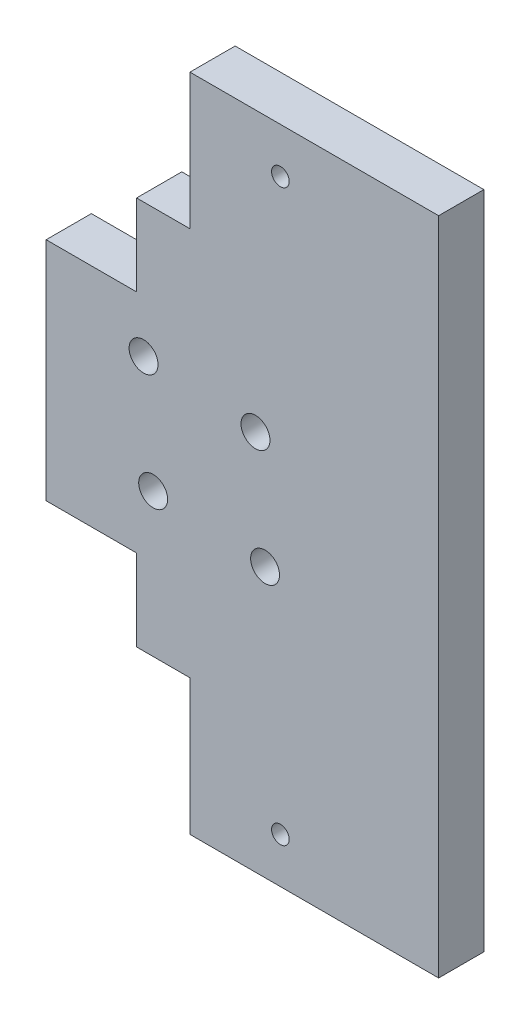
ISO-10303-21;
HEADER;
FILE_DESCRIPTION(('STEP AP214'),'2;1');
FILE_NAME('part.step','',(''),(''),'','','');
FILE_SCHEMA(('AUTOMOTIVE_DESIGN { 1 0 10303 214 1 1 1 1 }'));
ENDSEC;
DATA;
#1=APPLICATION_CONTEXT('core data for automotive mechanical design processes');
#2=APPLICATION_PROTOCOL_DEFINITION('international standard','automotive_design',2000,#1);
#3=PRODUCT_CONTEXT('',#1,'mechanical');
#4=PRODUCT('Part','Part','',(#3));
#5=PRODUCT_RELATED_PRODUCT_CATEGORY('part','',(#4));
#6=PRODUCT_DEFINITION_FORMATION('','',#4);
#7=PRODUCT_DEFINITION_CONTEXT('part definition',#1,'design');
#8=PRODUCT_DEFINITION('design','',#6,#7);
#9=PRODUCT_DEFINITION_SHAPE('','',#8);
#10=(LENGTH_UNIT() NAMED_UNIT(*) SI_UNIT(.MILLI.,.METRE.));
#11=(NAMED_UNIT(*) PLANE_ANGLE_UNIT() SI_UNIT($,.RADIAN.));
#12=(NAMED_UNIT(*) SI_UNIT($,.STERADIAN.) SOLID_ANGLE_UNIT());
#13=UNCERTAINTY_MEASURE_WITH_UNIT(LENGTH_MEASURE(1.E-05),#10,'distance_accuracy_value','');
#14=(GEOMETRIC_REPRESENTATION_CONTEXT(3) GLOBAL_UNCERTAINTY_ASSIGNED_CONTEXT((#13)) GLOBAL_UNIT_ASSIGNED_CONTEXT((#10,
#11,#12)) REPRESENTATION_CONTEXT('',''));
#15=CARTESIAN_POINT('',(0.,0.,0.));
#16=DIRECTION('',(0.,0.,1.));
#17=DIRECTION('',(1.,0.,0.));
#18=AXIS2_PLACEMENT_3D('',#15,#16,#17);
#19=CARTESIAN_POINT('',(-19.2,36.5,5.));
#20=DIRECTION('',(1.,0.,0.));
#21=DIRECTION('',(0.,1.,0.));
#22=AXIS2_PLACEMENT_3D('',#19,#20,#21);
#23=PLANE('',#22);
#24=DIRECTION('',(0.,0.,-1.));
#25=VECTOR('',#24,1.);
#26=CARTESIAN_POINT('',(-19.2,21.5,0.));
#27=LINE('',#26,#25);
#28=CARTESIAN_POINT('',(-19.2,21.5,5.));
#29=VERTEX_POINT('',#28);
#30=CARTESIAN_POINT('',(-19.2,21.5,0.));
#31=VERTEX_POINT('',#30);
#32=EDGE_CURVE('E275',#29,#31,#27,.T.);
#33=ORIENTED_EDGE('',*,*,#32,.T.);
#34=DIRECTION('',(0.,-1.,0.));
#35=VECTOR('',#34,1.);
#36=CARTESIAN_POINT('',(-19.2,36.5,0.));
#37=LINE('',#36,#35);
#38=CARTESIAN_POINT('',(-19.2,12.5,0.));
#39=VERTEX_POINT('',#38);
#40=EDGE_CURVE('E152',#31,#39,#37,.T.);
#41=ORIENTED_EDGE('',*,*,#40,.T.);
#42=DIRECTION('',(0.,0.,-1.));
#43=VECTOR('',#42,1.);
#44=CARTESIAN_POINT('',(-19.2,12.5,0.));
#45=LINE('',#44,#43);
#46=CARTESIAN_POINT('',(-19.2,12.5,5.));
#47=VERTEX_POINT('',#46);
#48=EDGE_CURVE('E177',#47,#39,#45,.T.);
#49=ORIENTED_EDGE('',*,*,#48,.F.);
#50=DIRECTION('',(0.,-1.,0.));
#51=VECTOR('',#50,1.);
#52=CARTESIAN_POINT('',(-19.2,36.5,5.));
#53=LINE('',#52,#51);
#54=EDGE_CURVE('E211',#29,#47,#53,.T.);
#55=ORIENTED_EDGE('',*,*,#54,.F.);
#56=EDGE_LOOP('',(#33,#41,#49,#55));
#57=FACE_BOUND('',#56,.T.);
#58=ADVANCED_FACE('F41',(#57),#23,.F.);
#59=CARTESIAN_POINT('',(-19.2,36.5,5.));
#60=DIRECTION('',(0.,-1.,0.));
#61=DIRECTION('',(0.,0.,-1.));
#62=AXIS2_PLACEMENT_3D('',#59,#60,#61);
#63=PLANE('',#62);
#64=DIRECTION('',(-1.,0.,0.));
#65=VECTOR('',#64,1.);
#66=CARTESIAN_POINT('',(-19.2,36.5,5.));
#67=LINE('',#66,#65);
#68=CARTESIAN_POINT('',(14.2,36.5,5.));
#69=VERTEX_POINT('',#68);
#70=CARTESIAN_POINT('',(-13.3,36.5,5.));
#71=VERTEX_POINT('',#70);
#72=EDGE_CURVE('E151',#69,#71,#67,.T.);
#73=ORIENTED_EDGE('',*,*,#72,.F.);
#74=DIRECTION('',(0.,0.,-1.));
#75=VECTOR('',#74,1.);
#76=CARTESIAN_POINT('',(14.2,36.5,10.));
#77=LINE('',#76,#75);
#78=CARTESIAN_POINT('',(14.2,36.5,0.));
#79=VERTEX_POINT('',#78);
#80=EDGE_CURVE('E144',#69,#79,#77,.T.);
#81=ORIENTED_EDGE('',*,*,#80,.T.);
#82=DIRECTION('',(-1.,0.,0.));
#83=VECTOR('',#82,1.);
#84=CARTESIAN_POINT('',(-19.2,36.5,0.));
#85=LINE('',#84,#83);
#86=CARTESIAN_POINT('',(-13.3,36.5,0.));
#87=VERTEX_POINT('',#86);
#88=EDGE_CURVE('E142',#79,#87,#85,.T.);
#89=ORIENTED_EDGE('',*,*,#88,.T.);
#90=DIRECTION('',(0.,0.,-1.));
#91=VECTOR('',#90,1.);
#92=CARTESIAN_POINT('',(-13.3,36.5,0.));
#93=LINE('',#92,#91);
#94=EDGE_CURVE('E298',#71,#87,#93,.T.);
#95=ORIENTED_EDGE('',*,*,#94,.F.);
#96=EDGE_LOOP('',(#73,#81,#89,#95));
#97=FACE_BOUND('',#96,.T.);
#98=ADVANCED_FACE('F43',(#97),#63,.F.);
#99=CARTESIAN_POINT('',(0.,0.,5.));
#100=DIRECTION('',(0.,0.,1.));
#101=DIRECTION('',(1.,0.,0.));
#102=AXIS2_PLACEMENT_3D('',#99,#100,#101);
#103=PLANE('',#102);
#104=CARTESIAN_POINT('',(-3.30000000000001,31.5,5.));
#105=DIRECTION('',(0.,0.,1.));
#106=DIRECTION('',(1.,0.,0.));
#107=AXIS2_PLACEMENT_3D('',#104,#105,#106);
#108=CIRCLE('',#107,0.974999999999999);
#109=CARTESIAN_POINT('',(-2.32500000000001,31.5,5.));
#110=VERTEX_POINT('',#109);
#111=EDGE_CURVE('E145',#110,#110,#108,.T.);
#112=ORIENTED_EDGE('',*,*,#111,.F.);
#113=EDGE_LOOP('',(#112));
#114=FACE_BOUND('',#113,.T.);
#115=CARTESIAN_POINT('',(-3.3,-31.5,5.));
#116=DIRECTION('',(0.,0.,1.));
#117=DIRECTION('',(1.,0.,0.));
#118=AXIS2_PLACEMENT_3D('',#115,#116,#117);
#119=CIRCLE('',#118,0.975);
#120=CARTESIAN_POINT('',(-2.325,-31.5,5.));
#121=VERTEX_POINT('',#120);
#122=EDGE_CURVE('E311',#121,#121,#119,.T.);
#123=ORIENTED_EDGE('',*,*,#122,.F.);
#124=EDGE_LOOP('',(#123));
#125=FACE_BOUND('',#124,.T.);
#126=DIRECTION('',(0.,-1.,0.));
#127=VECTOR('',#126,1.);
#128=CARTESIAN_POINT('',(14.2,0.,5.));
#129=LINE('',#128,#127);
#130=CARTESIAN_POINT('',(14.2,-36.5,5.));
#131=VERTEX_POINT('',#130);
#132=EDGE_CURVE('E57',#69,#131,#129,.T.);
#133=ORIENTED_EDGE('',*,*,#132,.F.);
#134=ORIENTED_EDGE('',*,*,#72,.T.);
#135=DIRECTION('',(0.,-1.,0.));
#136=VECTOR('',#135,1.);
#137=CARTESIAN_POINT('',(-13.3,0.,5.));
#138=LINE('',#137,#136);
#139=CARTESIAN_POINT('',(-13.3,21.5,5.));
#140=VERTEX_POINT('',#139);
#141=EDGE_CURVE('E291',#71,#140,#138,.T.);
#142=ORIENTED_EDGE('',*,*,#141,.T.);
#143=DIRECTION('',(-1.,0.,0.));
#144=VECTOR('',#143,1.);
#145=CARTESIAN_POINT('',(-13.3,21.5,5.));
#146=LINE('',#145,#144);
#147=EDGE_CURVE('E262',#140,#29,#146,.T.);
#148=ORIENTED_EDGE('',*,*,#147,.T.);
#149=ORIENTED_EDGE('',*,*,#54,.T.);
#150=DIRECTION('',(1.,0.,0.));
#151=VECTOR('',#150,1.);
#152=CARTESIAN_POINT('',(-29.2,12.5,5.));
#153=LINE('',#152,#151);
#154=CARTESIAN_POINT('',(-29.2,12.5,5.));
#155=VERTEX_POINT('',#154);
#156=EDGE_CURVE('E208',#155,#47,#153,.T.);
#157=ORIENTED_EDGE('',*,*,#156,.F.);
#158=DIRECTION('',(0.,1.,0.));
#159=VECTOR('',#158,1.);
#160=CARTESIAN_POINT('',(-29.2,-12.5,5.));
#161=LINE('',#160,#159);
#162=CARTESIAN_POINT('',(-29.2,-12.5,5.));
#163=VERTEX_POINT('',#162);
#164=EDGE_CURVE('E191',#163,#155,#161,.T.);
#165=ORIENTED_EDGE('',*,*,#164,.F.);
#166=DIRECTION('',(1.,0.,0.));
#167=VECTOR('',#166,1.);
#168=CARTESIAN_POINT('',(-29.2,-12.5,5.));
#169=LINE('',#168,#167);
#170=CARTESIAN_POINT('',(-19.2,-12.5,5.));
#171=VERTEX_POINT('',#170);
#172=EDGE_CURVE('E197',#163,#171,#169,.T.);
#173=ORIENTED_EDGE('',*,*,#172,.T.);
#174=CARTESIAN_POINT('',(-19.2,-21.5,5.));
#175=VERTEX_POINT('',#174);
#176=EDGE_CURVE('E156',#171,#175,#53,.T.);
#177=ORIENTED_EDGE('',*,*,#176,.T.);
#178=DIRECTION('',(-1.,0.,0.));
#179=VECTOR('',#178,1.);
#180=CARTESIAN_POINT('',(-13.3,-21.5,5.));
#181=LINE('',#180,#179);
#182=CARTESIAN_POINT('',(-13.3,-21.5,5.));
#183=VERTEX_POINT('',#182);
#184=EDGE_CURVE('E276',#183,#175,#181,.T.);
#185=ORIENTED_EDGE('',*,*,#184,.F.);
#186=DIRECTION('',(0.,1.,0.));
#187=VECTOR('',#186,1.);
#188=CARTESIAN_POINT('',(-13.3,-36.5,5.));
#189=LINE('',#188,#187);
#190=CARTESIAN_POINT('',(-13.3,-36.5,5.));
#191=VERTEX_POINT('',#190);
#192=EDGE_CURVE('E270',#191,#183,#189,.T.);
#193=ORIENTED_EDGE('',*,*,#192,.F.);
#194=DIRECTION('',(1.,0.,0.));
#195=VECTOR('',#194,1.);
#196=CARTESIAN_POINT('',(-19.2,-36.5,5.));
#197=LINE('',#196,#195);
#198=EDGE_CURVE('E50',#191,#131,#197,.T.);
#199=ORIENTED_EDGE('',*,*,#198,.T.);
#200=EDGE_LOOP('',(#133,#134,#142,#148,#149,#157,#165,#173,#177,#185,#193,#199));
#201=FACE_BOUND('',#200,.T.);
#202=CARTESIAN_POINT('',(-6.05314575050762,5.65685424949238,5.));
#203=DIRECTION('',(0.,0.,1.));
#204=DIRECTION('',(1.,0.,0.));
#205=AXIS2_PLACEMENT_3D('',#202,#203,#204);
#206=CIRCLE('',#205,1.6);
#207=CARTESIAN_POINT('',(-4.45314575050762,5.65685424949238,5.));
#208=VERTEX_POINT('',#207);
#209=EDGE_CURVE('E250',#208,#208,#206,.T.);
#210=ORIENTED_EDGE('',*,*,#209,.F.);
#211=EDGE_LOOP('',(#210));
#212=FACE_BOUND('',#211,.T.);
#213=CARTESIAN_POINT('',(-17.3668542494924,-5.65685424949238,5.));
#214=DIRECTION('',(0.,0.,1.));
#215=DIRECTION('',(1.,0.,0.));
#216=AXIS2_PLACEMENT_3D('',#213,#214,#215);
#217=CIRCLE('',#216,1.6);
#218=CARTESIAN_POINT('',(-15.7668542494924,-5.65685424949238,5.));
#219=VERTEX_POINT('',#218);
#220=EDGE_CURVE('E251',#219,#219,#217,.T.);
#221=ORIENTED_EDGE('',*,*,#220,.F.);
#222=EDGE_LOOP('',(#221));
#223=FACE_BOUND('',#222,.T.);
#224=CARTESIAN_POINT('',(-4.9924855787278,-6.7175144212722,5.));
#225=DIRECTION('',(0.,0.,1.));
#226=DIRECTION('',(1.,0.,0.));
#227=AXIS2_PLACEMENT_3D('',#224,#225,#226);
#228=CIRCLE('',#227,1.6);
#229=CARTESIAN_POINT('',(-3.3924855787278,-6.7175144212722,5.));
#230=VERTEX_POINT('',#229);
#231=EDGE_CURVE('E255',#230,#230,#228,.T.);
#232=ORIENTED_EDGE('',*,*,#231,.F.);
#233=EDGE_LOOP('',(#232));
#234=FACE_BOUND('',#233,.T.);
#235=CARTESIAN_POINT('',(-18.4275144212722,6.7175144212722,5.));
#236=DIRECTION('',(0.,0.,1.));
#237=DIRECTION('',(1.,0.,0.));
#238=AXIS2_PLACEMENT_3D('',#235,#236,#237);
#239=CIRCLE('',#238,1.6);
#240=CARTESIAN_POINT('',(-16.8275144212722,6.7175144212722,5.));
#241=VERTEX_POINT('',#240);
#242=EDGE_CURVE('E167',#241,#241,#239,.T.);
#243=ORIENTED_EDGE('',*,*,#242,.F.);
#244=EDGE_LOOP('',(#243));
#245=FACE_BOUND('',#244,.T.);
#246=ADVANCED_FACE('F328',(#114,#125,#201,#212,#223,#234,#245),#103,.T.);
#247=CARTESIAN_POINT('',(0.,0.,0.));
#248=DIRECTION('',(0.,0.,1.));
#249=DIRECTION('',(1.,0.,0.));
#250=AXIS2_PLACEMENT_3D('',#247,#248,#249);
#251=PLANE('',#250);
#252=CARTESIAN_POINT('',(-3.30000000000001,31.5,0.));
#253=DIRECTION('',(0.,0.,-1.));
#254=DIRECTION('',(-1.,0.,0.));
#255=AXIS2_PLACEMENT_3D('',#252,#253,#254);
#256=CIRCLE('',#255,0.974999999999999);
#257=CARTESIAN_POINT('',(-4.27500000000001,31.5,0.));
#258=VERTEX_POINT('',#257);
#259=EDGE_CURVE('E315',#258,#258,#256,.T.);
#260=ORIENTED_EDGE('',*,*,#259,.F.);
#261=EDGE_LOOP('',(#260));
#262=FACE_BOUND('',#261,.T.);
#263=CARTESIAN_POINT('',(-3.3,-31.5,0.));
#264=DIRECTION('',(0.,0.,-1.));
#265=DIRECTION('',(-1.,0.,0.));
#266=AXIS2_PLACEMENT_3D('',#263,#264,#265);
#267=CIRCLE('',#266,0.975);
#268=CARTESIAN_POINT('',(-4.275,-31.5,0.));
#269=VERTEX_POINT('',#268);
#270=EDGE_CURVE('E316',#269,#269,#267,.T.);
#271=ORIENTED_EDGE('',*,*,#270,.F.);
#272=EDGE_LOOP('',(#271));
#273=FACE_BOUND('',#272,.T.);
#274=CARTESIAN_POINT('',(-18.4275144212722,6.7175144212722,0.));
#275=DIRECTION('',(0.,0.,1.));
#276=DIRECTION('',(1.,0.,0.));
#277=AXIS2_PLACEMENT_3D('',#274,#275,#276);
#278=CIRCLE('',#277,1.6);
#279=CARTESIAN_POINT('',(-16.8275144212722,6.7175144212722,0.));
#280=VERTEX_POINT('',#279);
#281=EDGE_CURVE('E162',#280,#280,#278,.T.);
#282=ORIENTED_EDGE('',*,*,#281,.T.);
#283=EDGE_LOOP('',(#282));
#284=FACE_BOUND('',#283,.T.);
#285=CARTESIAN_POINT('',(-4.9924855787278,-6.7175144212722,0.));
#286=DIRECTION('',(0.,0.,1.));
#287=DIRECTION('',(1.,0.,0.));
#288=AXIS2_PLACEMENT_3D('',#285,#286,#287);
#289=CIRCLE('',#288,1.6);
#290=CARTESIAN_POINT('',(-3.3924855787278,-6.7175144212722,0.));
#291=VERTEX_POINT('',#290);
#292=EDGE_CURVE('E166',#291,#291,#289,.T.);
#293=ORIENTED_EDGE('',*,*,#292,.T.);
#294=EDGE_LOOP('',(#293));
#295=FACE_BOUND('',#294,.T.);
#296=CARTESIAN_POINT('',(-17.3668542494924,-5.65685424949238,0.));
#297=DIRECTION('',(0.,0.,1.));
#298=DIRECTION('',(1.,0.,0.));
#299=AXIS2_PLACEMENT_3D('',#296,#297,#298);
#300=CIRCLE('',#299,1.6);
#301=CARTESIAN_POINT('',(-15.7668542494924,-5.65685424949238,0.));
#302=VERTEX_POINT('',#301);
#303=EDGE_CURVE('E171',#302,#302,#300,.T.);
#304=ORIENTED_EDGE('',*,*,#303,.T.);
#305=EDGE_LOOP('',(#304));
#306=FACE_BOUND('',#305,.T.);
#307=CARTESIAN_POINT('',(-6.05314575050762,5.65685424949238,0.));
#308=DIRECTION('',(0.,0.,1.));
#309=DIRECTION('',(1.,0.,0.));
#310=AXIS2_PLACEMENT_3D('',#307,#308,#309);
#311=CIRCLE('',#310,1.6);
#312=CARTESIAN_POINT('',(-4.45314575050762,5.65685424949238,0.));
#313=VERTEX_POINT('',#312);
#314=EDGE_CURVE('E174',#313,#313,#311,.T.);
#315=ORIENTED_EDGE('',*,*,#314,.T.);
#316=EDGE_LOOP('',(#315));
#317=FACE_BOUND('',#316,.T.);
#318=ORIENTED_EDGE('',*,*,#88,.F.);
#319=DIRECTION('',(0.,1.,0.));
#320=VECTOR('',#319,1.);
#321=CARTESIAN_POINT('',(14.2,36.5,0.));
#322=LINE('',#321,#320);
#323=CARTESIAN_POINT('',(14.2,-36.5,0.));
#324=VERTEX_POINT('',#323);
#325=EDGE_CURVE('E129',#324,#79,#322,.T.);
#326=ORIENTED_EDGE('',*,*,#325,.F.);
#327=DIRECTION('',(1.,0.,0.));
#328=VECTOR('',#327,1.);
#329=CARTESIAN_POINT('',(-19.2,-36.5,0.));
#330=LINE('',#329,#328);
#331=CARTESIAN_POINT('',(-13.3,-36.5,0.));
#332=VERTEX_POINT('',#331);
#333=EDGE_CURVE('E140',#332,#324,#330,.T.);
#334=ORIENTED_EDGE('',*,*,#333,.F.);
#335=DIRECTION('',(0.,1.,0.));
#336=VECTOR('',#335,1.);
#337=CARTESIAN_POINT('',(-13.3,-36.5,0.));
#338=LINE('',#337,#336);
#339=CARTESIAN_POINT('',(-13.3,-21.5,0.));
#340=VERTEX_POINT('',#339);
#341=EDGE_CURVE('E265',#332,#340,#338,.T.);
#342=ORIENTED_EDGE('',*,*,#341,.T.);
#343=DIRECTION('',(-1.,0.,0.));
#344=VECTOR('',#343,1.);
#345=CARTESIAN_POINT('',(-13.3,-21.5,0.));
#346=LINE('',#345,#344);
#347=CARTESIAN_POINT('',(-19.2,-21.5,0.));
#348=VERTEX_POINT('',#347);
#349=EDGE_CURVE('E231',#340,#348,#346,.T.);
#350=ORIENTED_EDGE('',*,*,#349,.T.);
#351=CARTESIAN_POINT('',(-19.2,-12.5,0.));
#352=VERTEX_POINT('',#351);
#353=EDGE_CURVE('E158',#352,#348,#37,.T.);
#354=ORIENTED_EDGE('',*,*,#353,.F.);
#355=DIRECTION('',(1.,0.,0.));
#356=VECTOR('',#355,1.);
#357=CARTESIAN_POINT('',(-29.2,-12.5,0.));
#358=LINE('',#357,#356);
#359=CARTESIAN_POINT('',(-29.2,-12.5,0.));
#360=VERTEX_POINT('',#359);
#361=EDGE_CURVE('E201',#360,#352,#358,.T.);
#362=ORIENTED_EDGE('',*,*,#361,.F.);
#363=DIRECTION('',(0.,-1.,0.));
#364=VECTOR('',#363,1.);
#365=CARTESIAN_POINT('',(-29.2,-12.5,0.));
#366=LINE('',#365,#364);
#367=CARTESIAN_POINT('',(-29.2,12.5,0.));
#368=VERTEX_POINT('',#367);
#369=EDGE_CURVE('E239',#368,#360,#366,.T.);
#370=ORIENTED_EDGE('',*,*,#369,.F.);
#371=DIRECTION('',(1.,0.,0.));
#372=VECTOR('',#371,1.);
#373=CARTESIAN_POINT('',(-29.2,12.5,0.));
#374=LINE('',#373,#372);
#375=EDGE_CURVE('E205',#368,#39,#374,.T.);
#376=ORIENTED_EDGE('',*,*,#375,.T.);
#377=ORIENTED_EDGE('',*,*,#40,.F.);
#378=DIRECTION('',(-1.,0.,0.));
#379=VECTOR('',#378,1.);
#380=CARTESIAN_POINT('',(-13.3,21.5,0.));
#381=LINE('',#380,#379);
#382=CARTESIAN_POINT('',(-13.3,21.5,0.));
#383=VERTEX_POINT('',#382);
#384=EDGE_CURVE('E281',#383,#31,#381,.T.);
#385=ORIENTED_EDGE('',*,*,#384,.F.);
#386=DIRECTION('',(0.,-1.,0.));
#387=VECTOR('',#386,1.);
#388=CARTESIAN_POINT('',(-13.3,0.,0.));
#389=LINE('',#388,#387);
#390=EDGE_CURVE('E294',#87,#383,#389,.T.);
#391=ORIENTED_EDGE('',*,*,#390,.F.);
#392=EDGE_LOOP('',(#318,#326,#334,#342,#350,#354,#362,#370,#376,#377,#385,#391));
#393=FACE_BOUND('',#392,.T.);
#394=ADVANCED_FACE('F138',(#262,#273,#284,#295,#306,#317,#393),#251,.F.);
#395=ORIENTED_EDGE('',*,*,#353,.T.);
#396=DIRECTION('',(0.,0.,-1.));
#397=VECTOR('',#396,1.);
#398=CARTESIAN_POINT('',(-19.2,-21.5,5.));
#399=LINE('',#398,#397);
#400=EDGE_CURVE('E225',#175,#348,#399,.T.);
#401=ORIENTED_EDGE('',*,*,#400,.F.);
#402=ORIENTED_EDGE('',*,*,#176,.F.);
#403=DIRECTION('',(0.,0.,1.));
#404=VECTOR('',#403,1.);
#405=CARTESIAN_POINT('',(-19.2,-12.5,0.));
#406=LINE('',#405,#404);
#407=EDGE_CURVE('E182',#352,#171,#406,.T.);
#408=ORIENTED_EDGE('',*,*,#407,.F.);
#409=EDGE_LOOP('',(#395,#401,#402,#408));
#410=FACE_BOUND('',#409,.T.);
#411=ADVANCED_FACE('F224',(#410),#23,.F.);
#412=CARTESIAN_POINT('',(-19.2,-36.5,5.));
#413=DIRECTION('',(0.,1.,0.));
#414=DIRECTION('',(0.,0.,1.));
#415=AXIS2_PLACEMENT_3D('',#412,#413,#414);
#416=PLANE('',#415);
#417=ORIENTED_EDGE('',*,*,#333,.T.);
#418=DIRECTION('',(0.,0.,1.));
#419=VECTOR('',#418,1.);
#420=CARTESIAN_POINT('',(14.2,-36.5,5.));
#421=LINE('',#420,#419);
#422=EDGE_CURVE('E11',#324,#131,#421,.T.);
#423=ORIENTED_EDGE('',*,*,#422,.T.);
#424=ORIENTED_EDGE('',*,*,#198,.F.);
#425=DIRECTION('',(0.,0.,-1.));
#426=VECTOR('',#425,1.);
#427=CARTESIAN_POINT('',(-13.3,-36.5,5.));
#428=LINE('',#427,#426);
#429=EDGE_CURVE('E149',#191,#332,#428,.T.);
#430=ORIENTED_EDGE('',*,*,#429,.T.);
#431=EDGE_LOOP('',(#417,#423,#424,#430));
#432=FACE_BOUND('',#431,.T.);
#433=ADVANCED_FACE('F148',(#432),#416,.F.);
#434=CARTESIAN_POINT('',(-29.2,12.5,0.));
#435=DIRECTION('',(0.,-1.,0.));
#436=DIRECTION('',(1.,0.,0.));
#437=AXIS2_PLACEMENT_3D('',#434,#435,#436);
#438=PLANE('',#437);
#439=ORIENTED_EDGE('',*,*,#48,.T.);
#440=ORIENTED_EDGE('',*,*,#375,.F.);
#441=DIRECTION('',(0.,0.,-1.));
#442=VECTOR('',#441,1.);
#443=CARTESIAN_POINT('',(-29.2,12.5,0.));
#444=LINE('',#443,#442);
#445=EDGE_CURVE('E241',#155,#368,#444,.T.);
#446=ORIENTED_EDGE('',*,*,#445,.F.);
#447=ORIENTED_EDGE('',*,*,#156,.T.);
#448=EDGE_LOOP('',(#439,#440,#446,#447));
#449=FACE_BOUND('',#448,.T.);
#450=ADVANCED_FACE('F365',(#449),#438,.F.);
#451=CARTESIAN_POINT('',(-29.2,-12.5,0.));
#452=DIRECTION('',(0.,1.,0.));
#453=DIRECTION('',(-1.,0.,0.));
#454=AXIS2_PLACEMENT_3D('',#451,#452,#453);
#455=PLANE('',#454);
#456=ORIENTED_EDGE('',*,*,#407,.T.);
#457=ORIENTED_EDGE('',*,*,#172,.F.);
#458=DIRECTION('',(0.,0.,1.));
#459=VECTOR('',#458,1.);
#460=CARTESIAN_POINT('',(-29.2,-12.5,0.));
#461=LINE('',#460,#459);
#462=EDGE_CURVE('E194',#360,#163,#461,.T.);
#463=ORIENTED_EDGE('',*,*,#462,.F.);
#464=ORIENTED_EDGE('',*,*,#361,.T.);
#465=EDGE_LOOP('',(#456,#457,#463,#464));
#466=FACE_BOUND('',#465,.T.);
#467=ADVANCED_FACE('F233',(#466),#455,.F.);
#468=CARTESIAN_POINT('',(-29.2,0.,0.));
#469=DIRECTION('',(1.,0.,0.));
#470=DIRECTION('',(0.,1.,0.));
#471=AXIS2_PLACEMENT_3D('',#468,#469,#470);
#472=PLANE('',#471);
#473=ORIENTED_EDGE('',*,*,#164,.T.);
#474=ORIENTED_EDGE('',*,*,#445,.T.);
#475=ORIENTED_EDGE('',*,*,#369,.T.);
#476=ORIENTED_EDGE('',*,*,#462,.T.);
#477=EDGE_LOOP('',(#473,#474,#475,#476));
#478=FACE_BOUND('',#477,.T.);
#479=ADVANCED_FACE('F376',(#478),#472,.F.);
#480=CARTESIAN_POINT('',(-18.4275144212722,6.7175144212722,-20.));
#481=DIRECTION('',(0.,0.,1.));
#482=DIRECTION('',(1.,0.,0.));
#483=AXIS2_PLACEMENT_3D('',#480,#481,#482);
#484=CYLINDRICAL_SURFACE('',#483,1.6);
#485=ORIENTED_EDGE('',*,*,#242,.T.);
#486=EDGE_LOOP('',(#485));
#487=FACE_BOUND('',#486,.T.);
#488=ORIENTED_EDGE('',*,*,#281,.F.);
#489=EDGE_LOOP('',(#488));
#490=FACE_BOUND('',#489,.T.);
#491=ADVANCED_FACE('F351',(#487,#490),#484,.F.);
#492=CARTESIAN_POINT('',(-4.9924855787278,-6.7175144212722,-20.));
#493=DIRECTION('',(0.,0.,1.));
#494=DIRECTION('',(1.,0.,0.));
#495=AXIS2_PLACEMENT_3D('',#492,#493,#494);
#496=CYLINDRICAL_SURFACE('',#495,1.6);
#497=ORIENTED_EDGE('',*,*,#231,.T.);
#498=EDGE_LOOP('',(#497));
#499=FACE_BOUND('',#498,.T.);
#500=ORIENTED_EDGE('',*,*,#292,.F.);
#501=EDGE_LOOP('',(#500));
#502=FACE_BOUND('',#501,.T.);
#503=ADVANCED_FACE('F341',(#499,#502),#496,.F.);
#504=CARTESIAN_POINT('',(-17.3668542494924,-5.65685424949238,-20.));
#505=DIRECTION('',(0.,0.,1.));
#506=DIRECTION('',(1.,0.,0.));
#507=AXIS2_PLACEMENT_3D('',#504,#505,#506);
#508=CYLINDRICAL_SURFACE('',#507,1.6);
#509=ORIENTED_EDGE('',*,*,#220,.T.);
#510=EDGE_LOOP('',(#509));
#511=FACE_BOUND('',#510,.T.);
#512=ORIENTED_EDGE('',*,*,#303,.F.);
#513=EDGE_LOOP('',(#512));
#514=FACE_BOUND('',#513,.T.);
#515=ADVANCED_FACE('F338',(#511,#514),#508,.F.);
#516=CARTESIAN_POINT('',(-6.05314575050762,5.65685424949238,-20.));
#517=DIRECTION('',(0.,0.,1.));
#518=DIRECTION('',(1.,0.,0.));
#519=AXIS2_PLACEMENT_3D('',#516,#517,#518);
#520=CYLINDRICAL_SURFACE('',#519,1.6);
#521=ORIENTED_EDGE('',*,*,#209,.T.);
#522=EDGE_LOOP('',(#521));
#523=FACE_BOUND('',#522,.T.);
#524=ORIENTED_EDGE('',*,*,#314,.F.);
#525=EDGE_LOOP('',(#524));
#526=FACE_BOUND('',#525,.T.);
#527=ADVANCED_FACE('F340',(#523,#526),#520,.F.);
#528=CARTESIAN_POINT('',(-13.3,-21.5,5.));
#529=DIRECTION('',(0.,1.,0.));
#530=DIRECTION('',(-1.,0.,0.));
#531=AXIS2_PLACEMENT_3D('',#528,#529,#530);
#532=PLANE('',#531);
#533=ORIENTED_EDGE('',*,*,#400,.T.);
#534=ORIENTED_EDGE('',*,*,#349,.F.);
#535=DIRECTION('',(0.,0.,-1.));
#536=VECTOR('',#535,1.);
#537=CARTESIAN_POINT('',(-13.3,-21.5,5.));
#538=LINE('',#537,#536);
#539=EDGE_CURVE('E64',#183,#340,#538,.T.);
#540=ORIENTED_EDGE('',*,*,#539,.F.);
#541=ORIENTED_EDGE('',*,*,#184,.T.);
#542=EDGE_LOOP('',(#533,#534,#540,#541));
#543=FACE_BOUND('',#542,.T.);
#544=ADVANCED_FACE('F348',(#543),#532,.F.);
#545=CARTESIAN_POINT('',(-13.3,0.,0.));
#546=DIRECTION('',(1.,0.,0.));
#547=DIRECTION('',(0.,0.,-1.));
#548=AXIS2_PLACEMENT_3D('',#545,#546,#547);
#549=PLANE('',#548);
#550=ORIENTED_EDGE('',*,*,#539,.T.);
#551=ORIENTED_EDGE('',*,*,#341,.F.);
#552=ORIENTED_EDGE('',*,*,#429,.F.);
#553=ORIENTED_EDGE('',*,*,#192,.T.);
#554=EDGE_LOOP('',(#550,#551,#552,#553));
#555=FACE_BOUND('',#554,.T.);
#556=ADVANCED_FACE('F422',(#555),#549,.F.);
#557=CARTESIAN_POINT('',(-13.3,21.5,0.));
#558=DIRECTION('',(0.,1.,0.));
#559=DIRECTION('',(-1.,0.,0.));
#560=AXIS2_PLACEMENT_3D('',#557,#558,#559);
#561=PLANE('',#560);
#562=ORIENTED_EDGE('',*,*,#32,.F.);
#563=ORIENTED_EDGE('',*,*,#147,.F.);
#564=DIRECTION('',(0.,0.,-1.));
#565=VECTOR('',#564,1.);
#566=CARTESIAN_POINT('',(-13.3,21.5,0.));
#567=LINE('',#566,#565);
#568=EDGE_CURVE('E284',#140,#383,#567,.T.);
#569=ORIENTED_EDGE('',*,*,#568,.T.);
#570=ORIENTED_EDGE('',*,*,#384,.T.);
#571=EDGE_LOOP('',(#562,#563,#569,#570));
#572=FACE_BOUND('',#571,.T.);
#573=ADVANCED_FACE('F432',(#572),#561,.T.);
#574=CARTESIAN_POINT('',(-13.3,0.,0.));
#575=DIRECTION('',(-1.,0.,0.));
#576=DIRECTION('',(0.,-1.,0.));
#577=AXIS2_PLACEMENT_3D('',#574,#575,#576);
#578=PLANE('',#577);
#579=ORIENTED_EDGE('',*,*,#141,.F.);
#580=ORIENTED_EDGE('',*,*,#94,.T.);
#581=ORIENTED_EDGE('',*,*,#390,.T.);
#582=ORIENTED_EDGE('',*,*,#568,.F.);
#583=EDGE_LOOP('',(#579,#580,#581,#582));
#584=FACE_BOUND('',#583,.T.);
#585=ADVANCED_FACE('F441',(#584),#578,.T.);
#586=CARTESIAN_POINT('',(14.2,36.5,10.));
#587=DIRECTION('',(-1.,0.,0.));
#588=DIRECTION('',(0.,-1.,0.));
#589=AXIS2_PLACEMENT_3D('',#586,#587,#588);
#590=PLANE('',#589);
#591=ORIENTED_EDGE('',*,*,#132,.T.);
#592=ORIENTED_EDGE('',*,*,#422,.F.);
#593=ORIENTED_EDGE('',*,*,#325,.T.);
#594=ORIENTED_EDGE('',*,*,#80,.F.);
#595=EDGE_LOOP('',(#591,#592,#593,#594));
#596=FACE_BOUND('',#595,.T.);
#597=ADVANCED_FACE('F128',(#596),#590,.F.);
#598=CARTESIAN_POINT('',(-3.3,-31.5,13.));
#599=DIRECTION('',(0.,0.,-1.));
#600=DIRECTION('',(-1.,0.,0.));
#601=AXIS2_PLACEMENT_3D('',#598,#599,#600);
#602=CYLINDRICAL_SURFACE('',#601,0.975);
#603=ORIENTED_EDGE('',*,*,#122,.T.);
#604=EDGE_LOOP('',(#603));
#605=FACE_BOUND('',#604,.T.);
#606=ORIENTED_EDGE('',*,*,#270,.T.);
#607=EDGE_LOOP('',(#606));
#608=FACE_BOUND('',#607,.T.);
#609=ADVANCED_FACE('F469',(#605,#608),#602,.F.);
#610=CARTESIAN_POINT('',(-3.30000000000001,31.5,13.));
#611=DIRECTION('',(0.,0.,-1.));
#612=DIRECTION('',(-1.,0.,0.));
#613=AXIS2_PLACEMENT_3D('',#610,#611,#612);
#614=CYLINDRICAL_SURFACE('',#613,0.974999999999999);
#615=ORIENTED_EDGE('',*,*,#111,.T.);
#616=EDGE_LOOP('',(#615));
#617=FACE_BOUND('',#616,.T.);
#618=ORIENTED_EDGE('',*,*,#259,.T.);
#619=EDGE_LOOP('',(#618));
#620=FACE_BOUND('',#619,.T.);
#621=ADVANCED_FACE('F324',(#617,#620),#614,.F.);
#622=CLOSED_SHELL('',(#58,#98,#246,#394,#411,#433,#450,#467,#479,#491,#503,#515,#527,#544,#556,
#573,#585,#597,#609,#621));
#623=MANIFOLD_SOLID_BREP('B2',#622);
#624=ADVANCED_BREP_SHAPE_REPRESENTATION('',(#18,#623),#14);
#625=SHAPE_DEFINITION_REPRESENTATION(#9,#624);
ENDSEC;
END-ISO-10303-21;
